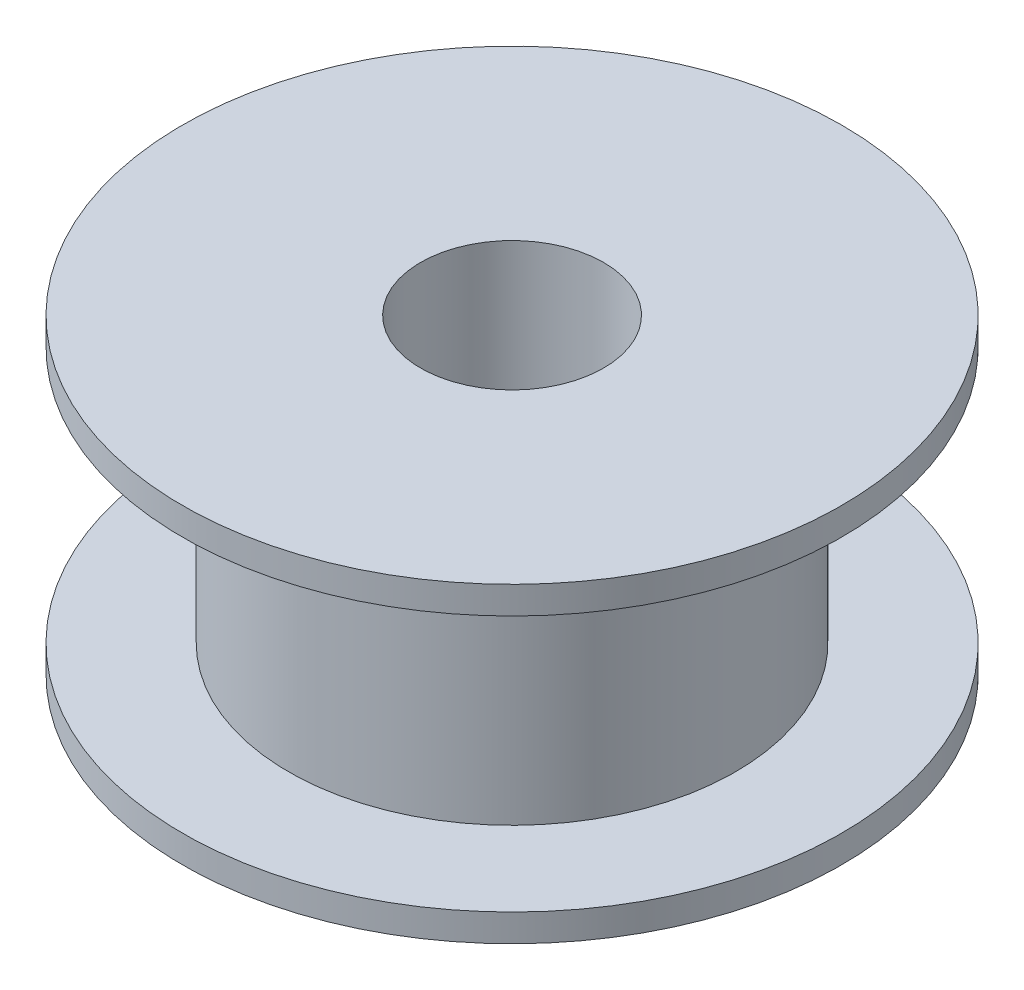
ISO-10303-21;
HEADER;
FILE_DESCRIPTION(('STEP AP214'),'2;1');
FILE_NAME('part.step','',(''),(''),'','','');
FILE_SCHEMA(('AUTOMOTIVE_DESIGN { 1 0 10303 214 1 1 1 1 }'));
ENDSEC;
DATA;
#1=APPLICATION_CONTEXT('core data for automotive mechanical design processes');
#2=APPLICATION_PROTOCOL_DEFINITION('international standard','automotive_design',2000,#1);
#3=PRODUCT_CONTEXT('',#1,'mechanical');
#4=PRODUCT('Part','Part','',(#3));
#5=PRODUCT_RELATED_PRODUCT_CATEGORY('part','',(#4));
#6=PRODUCT_DEFINITION_FORMATION('','',#4);
#7=PRODUCT_DEFINITION_CONTEXT('part definition',#1,'design');
#8=PRODUCT_DEFINITION('design','',#6,#7);
#9=PRODUCT_DEFINITION_SHAPE('','',#8);
#10=(LENGTH_UNIT() NAMED_UNIT(*) SI_UNIT(.MILLI.,.METRE.));
#11=(NAMED_UNIT(*) PLANE_ANGLE_UNIT() SI_UNIT($,.RADIAN.));
#12=(NAMED_UNIT(*) SI_UNIT($,.STERADIAN.) SOLID_ANGLE_UNIT());
#13=UNCERTAINTY_MEASURE_WITH_UNIT(LENGTH_MEASURE(1.E-05),#10,'distance_accuracy_value','');
#14=(GEOMETRIC_REPRESENTATION_CONTEXT(3) GLOBAL_UNCERTAINTY_ASSIGNED_CONTEXT((#13)) GLOBAL_UNIT_ASSIGNED_CONTEXT((#10,
#11,#12)) REPRESENTATION_CONTEXT('',''));
#15=CARTESIAN_POINT('',(0.,0.,0.));
#16=DIRECTION('',(0.,0.,1.));
#17=DIRECTION('',(1.,0.,0.));
#18=AXIS2_PLACEMENT_3D('',#15,#16,#17);
#19=CARTESIAN_POINT('',(6.1,0.75,0.));
#20=DIRECTION('',(0.,1.,0.));
#21=DIRECTION('',(0.,0.,1.));
#22=AXIS2_PLACEMENT_3D('',#19,#20,#21);
#23=PLANE('',#22);
#24=CARTESIAN_POINT('',(0.,0.75,0.));
#25=DIRECTION('',(0.,-1.,0.));
#26=DIRECTION('',(0.,0.,-1.));
#27=AXIS2_PLACEMENT_3D('',#24,#25,#26);
#28=CIRCLE('',#27,9.);
#29=CARTESIAN_POINT('',(0.,0.75,-9.));
#30=VERTEX_POINT('',#29);
#31=EDGE_CURVE('E17',#30,#30,#28,.T.);
#32=ORIENTED_EDGE('',*,*,#31,.F.);
#33=EDGE_LOOP('',(#32));
#34=FACE_BOUND('',#33,.T.);
#35=CARTESIAN_POINT('',(0.,0.75,0.));
#36=DIRECTION('',(0.,-1.,0.));
#37=DIRECTION('',(0.,0.,-1.));
#38=AXIS2_PLACEMENT_3D('',#35,#36,#37);
#39=CIRCLE('',#38,6.1);
#40=CARTESIAN_POINT('',(0.,0.75,-6.1));
#41=VERTEX_POINT('',#40);
#42=EDGE_CURVE('E39',#41,#41,#39,.F.);
#43=ORIENTED_EDGE('',*,*,#42,.F.);
#44=EDGE_LOOP('',(#43));
#45=FACE_BOUND('',#44,.T.);
#46=ADVANCED_FACE('F14',(#34,#45),#23,.T.);
#47=CARTESIAN_POINT('',(0.,0.,0.));
#48=DIRECTION('',(0.,-1.,0.));
#49=DIRECTION('',(0.,0.,-1.));
#50=AXIS2_PLACEMENT_3D('',#47,#48,#49);
#51=CYLINDRICAL_SURFACE('',#50,9.);
#52=ORIENTED_EDGE('',*,*,#31,.T.);
#53=EDGE_LOOP('',(#52));
#54=FACE_BOUND('',#53,.T.);
#55=CARTESIAN_POINT('',(0.,0.,0.));
#56=DIRECTION('',(0.,-1.,0.));
#57=DIRECTION('',(0.,0.,-1.));
#58=AXIS2_PLACEMENT_3D('',#55,#56,#57);
#59=CIRCLE('',#58,9.);
#60=CARTESIAN_POINT('',(0.,0.,-9.));
#61=VERTEX_POINT('',#60);
#62=EDGE_CURVE('E37',#61,#61,#59,.T.);
#63=ORIENTED_EDGE('',*,*,#62,.F.);
#64=EDGE_LOOP('',(#63));
#65=FACE_BOUND('',#64,.T.);
#66=ADVANCED_FACE('F46',(#54,#65),#51,.T.);
#67=CARTESIAN_POINT('',(0.,0.,0.));
#68=DIRECTION('',(0.,-1.,0.));
#69=DIRECTION('',(0.,0.,-1.));
#70=AXIS2_PLACEMENT_3D('',#67,#68,#69);
#71=CYLINDRICAL_SURFACE('',#70,6.1);
#72=CARTESIAN_POINT('',(0.,7.75,0.));
#73=DIRECTION('',(0.,-1.,0.));
#74=DIRECTION('',(0.,0.,-1.));
#75=AXIS2_PLACEMENT_3D('',#72,#73,#74);
#76=CIRCLE('',#75,6.1);
#77=CARTESIAN_POINT('',(0.,7.75,-6.1));
#78=VERTEX_POINT('',#77);
#79=EDGE_CURVE('E34',#78,#78,#76,.F.);
#80=ORIENTED_EDGE('',*,*,#79,.F.);
#81=EDGE_LOOP('',(#80));
#82=FACE_BOUND('',#81,.T.);
#83=ORIENTED_EDGE('',*,*,#42,.T.);
#84=EDGE_LOOP('',(#83));
#85=FACE_BOUND('',#84,.T.);
#86=ADVANCED_FACE('F55',(#82,#85),#71,.T.);
#87=CARTESIAN_POINT('',(9.,0.,0.));
#88=DIRECTION('',(0.,-1.,0.));
#89=DIRECTION('',(0.,0.,-1.));
#90=AXIS2_PLACEMENT_3D('',#87,#88,#89);
#91=PLANE('',#90);
#92=CARTESIAN_POINT('',(0.,0.,0.));
#93=DIRECTION('',(0.,-1.,0.));
#94=DIRECTION('',(0.,0.,-1.));
#95=AXIS2_PLACEMENT_3D('',#92,#93,#94);
#96=CIRCLE('',#95,2.5);
#97=CARTESIAN_POINT('',(0.,0.,-2.5));
#98=VERTEX_POINT('',#97);
#99=EDGE_CURVE('E31',#98,#98,#96,.F.);
#100=ORIENTED_EDGE('',*,*,#99,.T.);
#101=EDGE_LOOP('',(#100));
#102=FACE_BOUND('',#101,.T.);
#103=ORIENTED_EDGE('',*,*,#62,.T.);
#104=EDGE_LOOP('',(#103));
#105=FACE_BOUND('',#104,.T.);
#106=ADVANCED_FACE('F75',(#102,#105),#91,.T.);
#107=CARTESIAN_POINT('',(9.,7.75,0.));
#108=DIRECTION('',(0.,-1.,0.));
#109=DIRECTION('',(0.,0.,-1.));
#110=AXIS2_PLACEMENT_3D('',#107,#108,#109);
#111=PLANE('',#110);
#112=ORIENTED_EDGE('',*,*,#79,.T.);
#113=EDGE_LOOP('',(#112));
#114=FACE_BOUND('',#113,.T.);
#115=CARTESIAN_POINT('',(0.,7.75,0.));
#116=DIRECTION('',(0.,-1.,0.));
#117=DIRECTION('',(0.,0.,-1.));
#118=AXIS2_PLACEMENT_3D('',#115,#116,#117);
#119=CIRCLE('',#118,9.);
#120=CARTESIAN_POINT('',(0.,7.75,-9.));
#121=VERTEX_POINT('',#120);
#122=EDGE_CURVE('E26',#121,#121,#119,.F.);
#123=ORIENTED_EDGE('',*,*,#122,.F.);
#124=EDGE_LOOP('',(#123));
#125=FACE_BOUND('',#124,.T.);
#126=ADVANCED_FACE('F71',(#114,#125),#111,.T.);
#127=CARTESIAN_POINT('',(0.,0.,0.));
#128=DIRECTION('',(0.,-1.,0.));
#129=DIRECTION('',(0.,0.,-1.));
#130=AXIS2_PLACEMENT_3D('',#127,#128,#129);
#131=CYLINDRICAL_SURFACE('',#130,2.5);
#132=ORIENTED_EDGE('',*,*,#99,.F.);
#133=EDGE_LOOP('',(#132));
#134=FACE_BOUND('',#133,.T.);
#135=CARTESIAN_POINT('',(0.,8.5,0.));
#136=DIRECTION('',(0.,-1.,0.));
#137=DIRECTION('',(0.,0.,-1.));
#138=AXIS2_PLACEMENT_3D('',#135,#136,#137);
#139=CIRCLE('',#138,2.5);
#140=CARTESIAN_POINT('',(0.,8.5,-2.5));
#141=VERTEX_POINT('',#140);
#142=EDGE_CURVE('E21',#141,#141,#139,.T.);
#143=ORIENTED_EDGE('',*,*,#142,.F.);
#144=EDGE_LOOP('',(#143));
#145=FACE_BOUND('',#144,.T.);
#146=ADVANCED_FACE('F64',(#134,#145),#131,.F.);
#147=CARTESIAN_POINT('',(0.,0.,0.));
#148=DIRECTION('',(0.,-1.,0.));
#149=DIRECTION('',(0.,0.,-1.));
#150=AXIS2_PLACEMENT_3D('',#147,#148,#149);
#151=CYLINDRICAL_SURFACE('',#150,9.);
#152=CARTESIAN_POINT('',(0.,8.5,0.));
#153=DIRECTION('',(0.,-1.,0.));
#154=DIRECTION('',(0.,0.,-1.));
#155=AXIS2_PLACEMENT_3D('',#152,#153,#154);
#156=CIRCLE('',#155,9.);
#157=CARTESIAN_POINT('',(0.,8.5,-9.));
#158=VERTEX_POINT('',#157);
#159=EDGE_CURVE('E10',#158,#158,#156,.F.);
#160=ORIENTED_EDGE('',*,*,#159,.F.);
#161=EDGE_LOOP('',(#160));
#162=FACE_BOUND('',#161,.T.);
#163=ORIENTED_EDGE('',*,*,#122,.T.);
#164=EDGE_LOOP('',(#163));
#165=FACE_BOUND('',#164,.T.);
#166=ADVANCED_FACE('F58',(#162,#165),#151,.T.);
#167=CARTESIAN_POINT('',(2.5,8.5,0.));
#168=DIRECTION('',(0.,1.,0.));
#169=DIRECTION('',(0.,0.,1.));
#170=AXIS2_PLACEMENT_3D('',#167,#168,#169);
#171=PLANE('',#170);
#172=ORIENTED_EDGE('',*,*,#159,.T.);
#173=EDGE_LOOP('',(#172));
#174=FACE_BOUND('',#173,.T.);
#175=ORIENTED_EDGE('',*,*,#142,.T.);
#176=EDGE_LOOP('',(#175));
#177=FACE_BOUND('',#176,.T.);
#178=ADVANCED_FACE('F56',(#174,#177),#171,.T.);
#179=CLOSED_SHELL('',(#46,#66,#86,#106,#126,#146,#166,#178));
#180=MANIFOLD_SOLID_BREP('B1',#179);
#181=ADVANCED_BREP_SHAPE_REPRESENTATION('',(#18,#180),#14);
#182=SHAPE_DEFINITION_REPRESENTATION(#9,#181);
ENDSEC;
END-ISO-10303-21;
